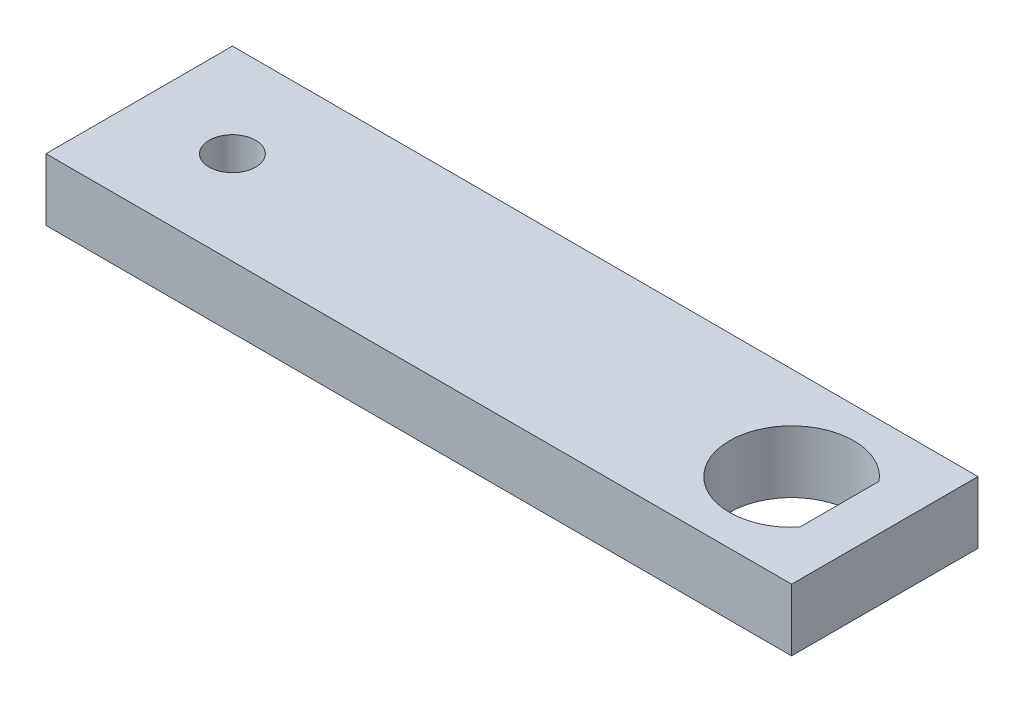
ISO-10303-21;
HEADER;
FILE_DESCRIPTION(('STEP AP214'),'2;1');
FILE_NAME('part.step','',(''),(''),'','','');
FILE_SCHEMA(('AUTOMOTIVE_DESIGN { 1 0 10303 214 1 1 1 1 }'));
ENDSEC;
DATA;
#1=APPLICATION_CONTEXT('core data for automotive mechanical design processes');
#2=APPLICATION_PROTOCOL_DEFINITION('international standard','automotive_design',2000,#1);
#3=PRODUCT_CONTEXT('',#1,'mechanical');
#4=PRODUCT('Part','Part','',(#3));
#5=PRODUCT_RELATED_PRODUCT_CATEGORY('part','',(#4));
#6=PRODUCT_DEFINITION_FORMATION('','',#4);
#7=PRODUCT_DEFINITION_CONTEXT('part definition',#1,'design');
#8=PRODUCT_DEFINITION('design','',#6,#7);
#9=PRODUCT_DEFINITION_SHAPE('','',#8);
#10=(LENGTH_UNIT() NAMED_UNIT(*) SI_UNIT(.MILLI.,.METRE.));
#11=(NAMED_UNIT(*) PLANE_ANGLE_UNIT() SI_UNIT($,.RADIAN.));
#12=(NAMED_UNIT(*) SI_UNIT($,.STERADIAN.) SOLID_ANGLE_UNIT());
#13=UNCERTAINTY_MEASURE_WITH_UNIT(LENGTH_MEASURE(1.E-05),#10,'distance_accuracy_value','');
#14=(GEOMETRIC_REPRESENTATION_CONTEXT(3) GLOBAL_UNCERTAINTY_ASSIGNED_CONTEXT((#13)) GLOBAL_UNIT_ASSIGNED_CONTEXT((#10,
#11,#12)) REPRESENTATION_CONTEXT('',''));
#15=CARTESIAN_POINT('',(0.,0.,0.));
#16=DIRECTION('',(0.,0.,1.));
#17=DIRECTION('',(1.,0.,0.));
#18=AXIS2_PLACEMENT_3D('',#15,#16,#17);
#19=CARTESIAN_POINT('',(0.,0.,19.05));
#20=DIRECTION('',(-1.,0.,0.));
#21=DIRECTION('',(0.,0.,1.));
#22=AXIS2_PLACEMENT_3D('',#19,#20,#21);
#23=PLANE('',#22);
#24=DIRECTION('',(0.,1.,0.));
#25=VECTOR('',#24,1.);
#26=CARTESIAN_POINT('',(0.,0.,0.));
#27=LINE('',#26,#25);
#28=CARTESIAN_POINT('',(0.,0.,0.));
#29=VERTEX_POINT('',#28);
#30=CARTESIAN_POINT('',(0.,6.35000000000001,0.));
#31=VERTEX_POINT('',#30);
#32=EDGE_CURVE('E132',#29,#31,#27,.T.);
#33=ORIENTED_EDGE('',*,*,#32,.F.);
#34=DIRECTION('',(0.,0.,-1.));
#35=VECTOR('',#34,1.);
#36=CARTESIAN_POINT('',(0.,0.,19.05));
#37=LINE('',#36,#35);
#38=CARTESIAN_POINT('',(0.,0.,19.05));
#39=VERTEX_POINT('',#38);
#40=EDGE_CURVE('E11',#39,#29,#37,.T.);
#41=ORIENTED_EDGE('',*,*,#40,.F.);
#42=DIRECTION('',(0.,1.,0.));
#43=VECTOR('',#42,1.);
#44=CARTESIAN_POINT('',(0.,0.,19.05));
#45=LINE('',#44,#43);
#46=CARTESIAN_POINT('',(0.,6.35000000000001,19.05));
#47=VERTEX_POINT('',#46);
#48=EDGE_CURVE('E134',#39,#47,#45,.T.);
#49=ORIENTED_EDGE('',*,*,#48,.T.);
#50=DIRECTION('',(0.,0.,-1.));
#51=VECTOR('',#50,1.);
#52=CARTESIAN_POINT('',(0.,6.35000000000001,19.05));
#53=LINE('',#52,#51);
#54=EDGE_CURVE('E43',#47,#31,#53,.T.);
#55=ORIENTED_EDGE('',*,*,#54,.T.);
#56=EDGE_LOOP('',(#33,#41,#49,#55));
#57=FACE_BOUND('',#56,.T.);
#58=ADVANCED_FACE('F40',(#57),#23,.T.);
#59=CARTESIAN_POINT('',(0.,0.,19.05));
#60=DIRECTION('',(0.,1.,0.));
#61=DIRECTION('',(-1.,0.,0.));
#62=AXIS2_PLACEMENT_3D('',#59,#60,#61);
#63=PLANE('',#62);
#64=CARTESIAN_POINT('',(9.525,0.,9.525));
#65=DIRECTION('',(0.,1.,0.));
#66=DIRECTION('',(-1.,0.,0.));
#67=AXIS2_PLACEMENT_3D('',#64,#65,#66);
#68=CIRCLE('',#67,2.38125);
#69=CARTESIAN_POINT('',(7.14375,0.,9.525));
#70=VERTEX_POINT('',#69);
#71=EDGE_CURVE('E129',#70,#70,#68,.T.);
#72=ORIENTED_EDGE('',*,*,#71,.T.);
#73=EDGE_LOOP('',(#72));
#74=FACE_BOUND('',#73,.T.);
#75=DIRECTION('',(0.,0.,1.));
#76=VECTOR('',#75,1.);
#77=CARTESIAN_POINT('',(71.5645,0.,5.47342132619889));
#78=LINE('',#77,#76);
#79=CARTESIAN_POINT('',(71.5645,0.,5.47342132619889));
#80=VERTEX_POINT('',#79);
#81=CARTESIAN_POINT('',(71.5645,0.,13.5765786738011));
#82=VERTEX_POINT('',#81);
#83=EDGE_CURVE('E104',#80,#82,#78,.T.);
#84=ORIENTED_EDGE('',*,*,#83,.F.);
#85=CARTESIAN_POINT('',(66.675,0.,9.525));
#86=DIRECTION('',(0.,1.,0.));
#87=DIRECTION('',(-1.,0.,0.));
#88=AXIS2_PLACEMENT_3D('',#85,#86,#87);
#89=CIRCLE('',#88,6.35);
#90=EDGE_CURVE('E57',#80,#82,#89,.T.);
#91=ORIENTED_EDGE('',*,*,#90,.T.);
#92=EDGE_LOOP('',(#84,#91));
#93=FACE_BOUND('',#92,.T.);
#94=DIRECTION('',(1.,0.,0.));
#95=VECTOR('',#94,1.);
#96=CARTESIAN_POINT('',(0.,0.,0.));
#97=LINE('',#96,#95);
#98=CARTESIAN_POINT('',(76.2,0.,0.));
#99=VERTEX_POINT('',#98);
#100=EDGE_CURVE('E138',#29,#99,#97,.T.);
#101=ORIENTED_EDGE('',*,*,#100,.T.);
#102=DIRECTION('',(0.,0.,-1.));
#103=VECTOR('',#102,1.);
#104=CARTESIAN_POINT('',(76.2,0.,19.05));
#105=LINE('',#104,#103);
#106=CARTESIAN_POINT('',(76.2,0.,19.05));
#107=VERTEX_POINT('',#106);
#108=EDGE_CURVE('E49',#107,#99,#105,.T.);
#109=ORIENTED_EDGE('',*,*,#108,.F.);
#110=DIRECTION('',(1.,0.,0.));
#111=VECTOR('',#110,1.);
#112=CARTESIAN_POINT('',(0.,0.,19.05));
#113=LINE('',#112,#111);
#114=EDGE_CURVE('E145',#39,#107,#113,.T.);
#115=ORIENTED_EDGE('',*,*,#114,.F.);
#116=ORIENTED_EDGE('',*,*,#40,.T.);
#117=EDGE_LOOP('',(#101,#109,#115,#116));
#118=FACE_BOUND('',#117,.T.);
#119=ADVANCED_FACE('F116',(#74,#93,#118),#63,.F.);
#120=CARTESIAN_POINT('',(76.2,6.35,19.05));
#121=DIRECTION('',(1.,0.,0.));
#122=DIRECTION('',(0.,0.,-1.));
#123=AXIS2_PLACEMENT_3D('',#120,#121,#122);
#124=PLANE('',#123);
#125=DIRECTION('',(0.,-1.,0.));
#126=VECTOR('',#125,1.);
#127=CARTESIAN_POINT('',(76.2,6.35,0.));
#128=LINE('',#127,#126);
#129=CARTESIAN_POINT('',(76.2,6.35,0.));
#130=VERTEX_POINT('',#129);
#131=EDGE_CURVE('E155',#130,#99,#128,.T.);
#132=ORIENTED_EDGE('',*,*,#131,.F.);
#133=DIRECTION('',(0.,0.,-1.));
#134=VECTOR('',#133,1.);
#135=CARTESIAN_POINT('',(76.2,6.35,19.05));
#136=LINE('',#135,#134);
#137=CARTESIAN_POINT('',(76.2,6.35,19.05));
#138=VERTEX_POINT('',#137);
#139=EDGE_CURVE('E163',#138,#130,#136,.T.);
#140=ORIENTED_EDGE('',*,*,#139,.F.);
#141=DIRECTION('',(0.,-1.,0.));
#142=VECTOR('',#141,1.);
#143=CARTESIAN_POINT('',(76.2,6.35,19.05));
#144=LINE('',#143,#142);
#145=EDGE_CURVE('E141',#138,#107,#144,.T.);
#146=ORIENTED_EDGE('',*,*,#145,.T.);
#147=ORIENTED_EDGE('',*,*,#108,.T.);
#148=EDGE_LOOP('',(#132,#140,#146,#147));
#149=FACE_BOUND('',#148,.T.);
#150=ADVANCED_FACE('F185',(#149),#124,.T.);
#151=CARTESIAN_POINT('',(76.2,6.35,19.05));
#152=DIRECTION('',(0.,-1.,0.));
#153=DIRECTION('',(1.,0.,0.));
#154=AXIS2_PLACEMENT_3D('',#151,#152,#153);
#155=PLANE('',#154);
#156=CARTESIAN_POINT('',(9.525,6.35000000000001,9.525));
#157=DIRECTION('',(0.,1.,0.));
#158=DIRECTION('',(-1.,0.,0.));
#159=AXIS2_PLACEMENT_3D('',#156,#157,#158);
#160=CIRCLE('',#159,2.38125);
#161=CARTESIAN_POINT('',(7.14375,6.35000000000001,9.525));
#162=VERTEX_POINT('',#161);
#163=EDGE_CURVE('E125',#162,#162,#160,.T.);
#164=ORIENTED_EDGE('',*,*,#163,.F.);
#165=EDGE_LOOP('',(#164));
#166=FACE_BOUND('',#165,.T.);
#167=DIRECTION('',(0.,0.,1.));
#168=VECTOR('',#167,1.);
#169=CARTESIAN_POINT('',(71.5645,6.35,5.47342132619889));
#170=LINE('',#169,#168);
#171=CARTESIAN_POINT('',(71.5645,6.35,5.47342132619889));
#172=VERTEX_POINT('',#171);
#173=CARTESIAN_POINT('',(71.5645,6.35,13.5765786738011));
#174=VERTEX_POINT('',#173);
#175=EDGE_CURVE('E119',#172,#174,#170,.T.);
#176=ORIENTED_EDGE('',*,*,#175,.T.);
#177=CARTESIAN_POINT('',(66.675,6.35,9.525));
#178=DIRECTION('',(0.,1.,0.));
#179=DIRECTION('',(-1.,0.,0.));
#180=AXIS2_PLACEMENT_3D('',#177,#178,#179);
#181=CIRCLE('',#180,6.35);
#182=EDGE_CURVE('E65',#172,#174,#181,.T.);
#183=ORIENTED_EDGE('',*,*,#182,.F.);
#184=EDGE_LOOP('',(#176,#183));
#185=FACE_BOUND('',#184,.T.);
#186=DIRECTION('',(-1.,0.,0.));
#187=VECTOR('',#186,1.);
#188=CARTESIAN_POINT('',(76.2,6.35,0.));
#189=LINE('',#188,#187);
#190=EDGE_CURVE('E151',#130,#31,#189,.T.);
#191=ORIENTED_EDGE('',*,*,#190,.T.);
#192=ORIENTED_EDGE('',*,*,#54,.F.);
#193=DIRECTION('',(-1.,0.,0.));
#194=VECTOR('',#193,1.);
#195=CARTESIAN_POINT('',(76.2,6.35,19.05));
#196=LINE('',#195,#194);
#197=EDGE_CURVE('E137',#138,#47,#196,.T.);
#198=ORIENTED_EDGE('',*,*,#197,.F.);
#199=ORIENTED_EDGE('',*,*,#139,.T.);
#200=EDGE_LOOP('',(#191,#192,#198,#199));
#201=FACE_BOUND('',#200,.T.);
#202=ADVANCED_FACE('F174',(#166,#185,#201),#155,.F.);
#203=CARTESIAN_POINT('',(0.,0.,19.05));
#204=DIRECTION('',(0.,0.,-1.));
#205=DIRECTION('',(-1.,0.,0.));
#206=AXIS2_PLACEMENT_3D('',#203,#204,#205);
#207=PLANE('',#206);
#208=ORIENTED_EDGE('',*,*,#48,.F.);
#209=ORIENTED_EDGE('',*,*,#114,.T.);
#210=ORIENTED_EDGE('',*,*,#145,.F.);
#211=ORIENTED_EDGE('',*,*,#197,.T.);
#212=EDGE_LOOP('',(#208,#209,#210,#211));
#213=FACE_BOUND('',#212,.T.);
#214=ADVANCED_FACE('F183',(#213),#207,.F.);
#215=CARTESIAN_POINT('',(0.,0.,0.));
#216=DIRECTION('',(0.,0.,-1.));
#217=DIRECTION('',(-1.,0.,0.));
#218=AXIS2_PLACEMENT_3D('',#215,#216,#217);
#219=PLANE('',#218);
#220=ORIENTED_EDGE('',*,*,#32,.T.);
#221=ORIENTED_EDGE('',*,*,#190,.F.);
#222=ORIENTED_EDGE('',*,*,#131,.T.);
#223=ORIENTED_EDGE('',*,*,#100,.F.);
#224=EDGE_LOOP('',(#220,#221,#222,#223));
#225=FACE_BOUND('',#224,.T.);
#226=ADVANCED_FACE('F178',(#225),#219,.T.);
#227=CARTESIAN_POINT('',(66.675,0.,9.525));
#228=DIRECTION('',(0.,1.,0.));
#229=DIRECTION('',(-1.,0.,0.));
#230=AXIS2_PLACEMENT_3D('',#227,#228,#229);
#231=CYLINDRICAL_SURFACE('',#230,6.35);
#232=ORIENTED_EDGE('',*,*,#182,.T.);
#233=DIRECTION('',(0.,1.,0.));
#234=VECTOR('',#233,1.);
#235=CARTESIAN_POINT('',(71.5645,0.,13.5765786738011));
#236=LINE('',#235,#234);
#237=EDGE_CURVE('E107',#82,#174,#236,.T.);
#238=ORIENTED_EDGE('',*,*,#237,.F.);
#239=ORIENTED_EDGE('',*,*,#90,.F.);
#240=DIRECTION('',(0.,1.,0.));
#241=VECTOR('',#240,1.);
#242=CARTESIAN_POINT('',(71.5645,0.,5.47342132619889));
#243=LINE('',#242,#241);
#244=EDGE_CURVE('E109',#80,#172,#243,.T.);
#245=ORIENTED_EDGE('',*,*,#244,.T.);
#246=EDGE_LOOP('',(#232,#238,#239,#245));
#247=FACE_BOUND('',#246,.T.);
#248=ADVANCED_FACE('F113',(#247),#231,.F.);
#249=CARTESIAN_POINT('',(71.5645,0.,5.47342132619889));
#250=DIRECTION('',(-1.,0.,0.));
#251=DIRECTION('',(0.,-1.,0.));
#252=AXIS2_PLACEMENT_3D('',#249,#250,#251);
#253=PLANE('',#252);
#254=ORIENTED_EDGE('',*,*,#175,.F.);
#255=ORIENTED_EDGE('',*,*,#244,.F.);
#256=ORIENTED_EDGE('',*,*,#83,.T.);
#257=ORIENTED_EDGE('',*,*,#237,.T.);
#258=EDGE_LOOP('',(#254,#255,#256,#257));
#259=FACE_BOUND('',#258,.T.);
#260=ADVANCED_FACE('F106',(#259),#253,.T.);
#261=CARTESIAN_POINT('',(9.525,0.,9.525));
#262=DIRECTION('',(0.,1.,0.));
#263=DIRECTION('',(-1.,0.,0.));
#264=AXIS2_PLACEMENT_3D('',#261,#262,#263);
#265=CYLINDRICAL_SURFACE('',#264,2.38125);
#266=ORIENTED_EDGE('',*,*,#71,.F.);
#267=EDGE_LOOP('',(#266));
#268=FACE_BOUND('',#267,.T.);
#269=ORIENTED_EDGE('',*,*,#163,.T.);
#270=EDGE_LOOP('',(#269));
#271=FACE_BOUND('',#270,.T.);
#272=ADVANCED_FACE('F238',(#268,#271),#265,.F.);
#273=CLOSED_SHELL('',(#58,#119,#150,#202,#214,#226,#248,#260,#272));
#274=MANIFOLD_SOLID_BREP('B2',#273);
#275=ADVANCED_BREP_SHAPE_REPRESENTATION('',(#18,#274),#14);
#276=SHAPE_DEFINITION_REPRESENTATION(#9,#275);
ENDSEC;
END-ISO-10303-21;
